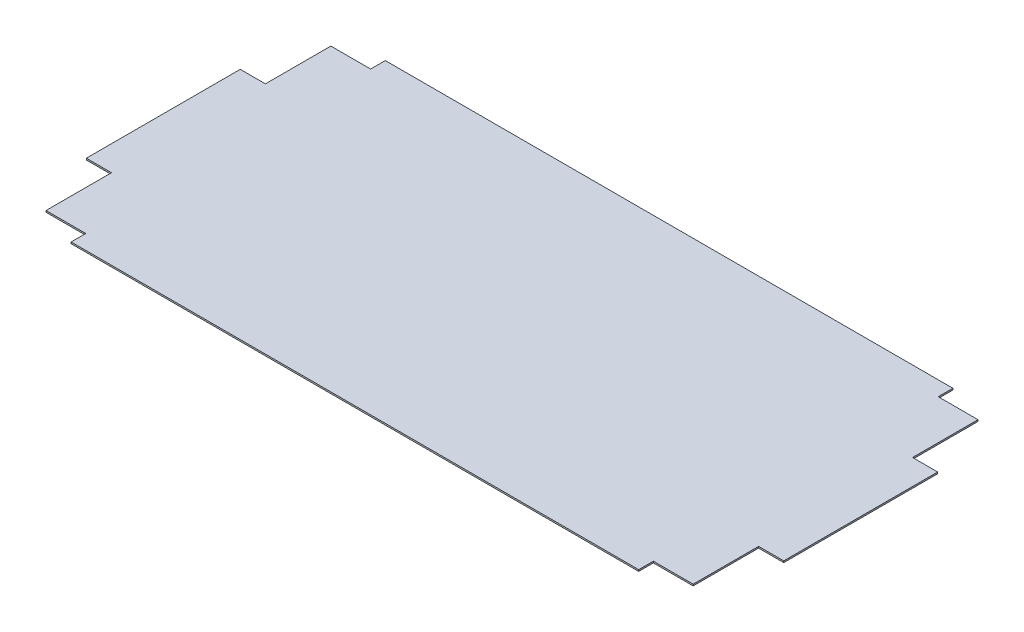
ISO-10303-21;
HEADER;
FILE_DESCRIPTION(('STEP AP214'),'2;1');
FILE_NAME('part.step','',(''),(''),'','','');
FILE_SCHEMA(('AUTOMOTIVE_DESIGN { 1 0 10303 214 1 1 1 1 }'));
ENDSEC;
DATA;
#1=APPLICATION_CONTEXT('core data for automotive mechanical design processes');
#2=APPLICATION_PROTOCOL_DEFINITION('international standard','automotive_design',2000,#1);
#3=PRODUCT_CONTEXT('',#1,'mechanical');
#4=PRODUCT('Part','Part','',(#3));
#5=PRODUCT_RELATED_PRODUCT_CATEGORY('part','',(#4));
#6=PRODUCT_DEFINITION_FORMATION('','',#4);
#7=PRODUCT_DEFINITION_CONTEXT('part definition',#1,'design');
#8=PRODUCT_DEFINITION('design','',#6,#7);
#9=PRODUCT_DEFINITION_SHAPE('','',#8);
#10=(LENGTH_UNIT() NAMED_UNIT(*) SI_UNIT(.MILLI.,.METRE.));
#11=(NAMED_UNIT(*) PLANE_ANGLE_UNIT() SI_UNIT($,.RADIAN.));
#12=(NAMED_UNIT(*) SI_UNIT($,.STERADIAN.) SOLID_ANGLE_UNIT());
#13=UNCERTAINTY_MEASURE_WITH_UNIT(LENGTH_MEASURE(1.E-05),#10,'distance_accuracy_value','');
#14=(GEOMETRIC_REPRESENTATION_CONTEXT(3) GLOBAL_UNCERTAINTY_ASSIGNED_CONTEXT((#13)) GLOBAL_UNIT_ASSIGNED_CONTEXT((#10,
#11,#12)) REPRESENTATION_CONTEXT('',''));
#15=CARTESIAN_POINT('',(0.,0.,0.));
#16=DIRECTION('',(0.,0.,1.));
#17=DIRECTION('',(1.,0.,0.));
#18=AXIS2_PLACEMENT_3D('',#15,#16,#17);
#19=CARTESIAN_POINT('',(333.,1.5,150.));
#20=DIRECTION('',(-1.,0.,0.));
#21=DIRECTION('',(0.,0.,1.));
#22=AXIS2_PLACEMENT_3D('',#19,#20,#21);
#23=PLANE('',#22);
#24=DIRECTION('',(0.,0.,-1.));
#25=VECTOR('',#24,1.);
#26=CARTESIAN_POINT('',(333.,1.5,150.));
#27=LINE('',#26,#25);
#28=CARTESIAN_POINT('',(333.,1.5,73.5000000000002));
#29=VERTEX_POINT('',#28);
#30=CARTESIAN_POINT('',(333.,1.5,-73.5));
#31=VERTEX_POINT('',#30);
#32=EDGE_CURVE('E317',#29,#31,#27,.T.);
#33=ORIENTED_EDGE('',*,*,#32,.F.);
#34=DIRECTION('',(0.,1.,0.));
#35=VECTOR('',#34,1.);
#36=CARTESIAN_POINT('',(333.,0.,73.5000000000002));
#37=LINE('',#36,#35);
#38=CARTESIAN_POINT('',(333.,0.,73.5000000000002));
#39=VERTEX_POINT('',#38);
#40=EDGE_CURVE('E203',#39,#29,#37,.T.);
#41=ORIENTED_EDGE('',*,*,#40,.F.);
#42=DIRECTION('',(0.,0.,-1.));
#43=VECTOR('',#42,1.);
#44=CARTESIAN_POINT('',(333.,0.,150.));
#45=LINE('',#44,#43);
#46=CARTESIAN_POINT('',(333.,0.,-73.5));
#47=VERTEX_POINT('',#46);
#48=EDGE_CURVE('E315',#39,#47,#45,.T.);
#49=ORIENTED_EDGE('',*,*,#48,.T.);
#50=DIRECTION('',(0.,1.,0.));
#51=VECTOR('',#50,1.);
#52=CARTESIAN_POINT('',(333.,0.,-73.5));
#53=LINE('',#52,#51);
#54=EDGE_CURVE('E217',#47,#31,#53,.T.);
#55=ORIENTED_EDGE('',*,*,#54,.T.);
#56=EDGE_LOOP('',(#33,#41,#49,#55));
#57=FACE_BOUND('',#56,.T.);
#58=ADVANCED_FACE('F32',(#57),#23,.F.);
#59=CARTESIAN_POINT('',(-333.,1.5,-150.));
#60=DIRECTION('',(0.,0.,1.));
#61=DIRECTION('',(1.,0.,0.));
#62=AXIS2_PLACEMENT_3D('',#59,#60,#61);
#63=PLANE('',#62);
#64=DIRECTION('',(-1.,0.,0.));
#65=VECTOR('',#64,1.);
#66=CARTESIAN_POINT('',(-333.,1.5,-150.));
#67=LINE('',#66,#65);
#68=CARTESIAN_POINT('',(271.,1.5,-150.));
#69=VERTEX_POINT('',#68);
#70=CARTESIAN_POINT('',(-271.,1.5,-150.));
#71=VERTEX_POINT('',#70);
#72=EDGE_CURVE('E319',#69,#71,#67,.T.);
#73=ORIENTED_EDGE('',*,*,#72,.F.);
#74=DIRECTION('',(0.,1.,0.));
#75=VECTOR('',#74,1.);
#76=CARTESIAN_POINT('',(271.,0.,-150.));
#77=LINE('',#76,#75);
#78=CARTESIAN_POINT('',(271.,0.,-150.));
#79=VERTEX_POINT('',#78);
#80=EDGE_CURVE('E271',#79,#69,#77,.T.);
#81=ORIENTED_EDGE('',*,*,#80,.F.);
#82=DIRECTION('',(-1.,0.,0.));
#83=VECTOR('',#82,1.);
#84=CARTESIAN_POINT('',(-333.,0.,-150.));
#85=LINE('',#84,#83);
#86=CARTESIAN_POINT('',(-271.,0.,-150.));
#87=VERTEX_POINT('',#86);
#88=EDGE_CURVE('E324',#79,#87,#85,.T.);
#89=ORIENTED_EDGE('',*,*,#88,.T.);
#90=DIRECTION('',(0.,1.,0.));
#91=VECTOR('',#90,1.);
#92=CARTESIAN_POINT('',(-271.,0.,-150.));
#93=LINE('',#92,#91);
#94=EDGE_CURVE('E294',#87,#71,#93,.T.);
#95=ORIENTED_EDGE('',*,*,#94,.T.);
#96=EDGE_LOOP('',(#73,#81,#89,#95));
#97=FACE_BOUND('',#96,.T.);
#98=ADVANCED_FACE('F372',(#97),#63,.F.);
#99=CARTESIAN_POINT('',(-333.,1.5,150.));
#100=DIRECTION('',(1.,0.,0.));
#101=DIRECTION('',(0.,0.,-1.));
#102=AXIS2_PLACEMENT_3D('',#99,#100,#101);
#103=PLANE('',#102);
#104=DIRECTION('',(0.,0.,1.));
#105=VECTOR('',#104,1.);
#106=CARTESIAN_POINT('',(-333.,0.,150.));
#107=LINE('',#106,#105);
#108=CARTESIAN_POINT('',(-333.,0.,-73.5));
#109=VERTEX_POINT('',#108);
#110=CARTESIAN_POINT('',(-333.,0.,73.5000000000002));
#111=VERTEX_POINT('',#110);
#112=EDGE_CURVE('E325',#109,#111,#107,.T.);
#113=ORIENTED_EDGE('',*,*,#112,.T.);
#114=DIRECTION('',(0.,1.,0.));
#115=VECTOR('',#114,1.);
#116=CARTESIAN_POINT('',(-333.,0.,73.5000000000002));
#117=LINE('',#116,#115);
#118=CARTESIAN_POINT('',(-333.,1.5,73.5000000000002));
#119=VERTEX_POINT('',#118);
#120=EDGE_CURVE('E190',#111,#119,#117,.T.);
#121=ORIENTED_EDGE('',*,*,#120,.T.);
#122=DIRECTION('',(0.,0.,1.));
#123=VECTOR('',#122,1.);
#124=CARTESIAN_POINT('',(-333.,1.5,150.));
#125=LINE('',#124,#123);
#126=CARTESIAN_POINT('',(-333.,1.5,-73.5));
#127=VERTEX_POINT('',#126);
#128=EDGE_CURVE('E40',#127,#119,#125,.T.);
#129=ORIENTED_EDGE('',*,*,#128,.F.);
#130=DIRECTION('',(0.,1.,0.));
#131=VECTOR('',#130,1.);
#132=CARTESIAN_POINT('',(-333.,0.,-73.5));
#133=LINE('',#132,#131);
#134=EDGE_CURVE('E226',#109,#127,#133,.T.);
#135=ORIENTED_EDGE('',*,*,#134,.F.);
#136=EDGE_LOOP('',(#113,#121,#129,#135));
#137=FACE_BOUND('',#136,.T.);
#138=ADVANCED_FACE('F388',(#137),#103,.F.);
#139=CARTESIAN_POINT('',(-333.,1.5,150.));
#140=DIRECTION('',(0.,0.,-1.));
#141=DIRECTION('',(-1.,0.,0.));
#142=AXIS2_PLACEMENT_3D('',#139,#140,#141);
#143=PLANE('',#142);
#144=DIRECTION('',(1.,0.,0.));
#145=VECTOR('',#144,1.);
#146=CARTESIAN_POINT('',(-333.,1.5,150.));
#147=LINE('',#146,#145);
#148=CARTESIAN_POINT('',(-271.,1.5,150.));
#149=VERTEX_POINT('',#148);
#150=CARTESIAN_POINT('',(271.,1.5,150.));
#151=VERTEX_POINT('',#150);
#152=EDGE_CURVE('E11',#149,#151,#147,.T.);
#153=ORIENTED_EDGE('',*,*,#152,.F.);
#154=DIRECTION('',(0.,1.,0.));
#155=VECTOR('',#154,1.);
#156=CARTESIAN_POINT('',(-271.,0.,150.));
#157=LINE('',#156,#155);
#158=CARTESIAN_POINT('',(-271.,0.,150.));
#159=VERTEX_POINT('',#158);
#160=EDGE_CURVE('E237',#159,#149,#157,.T.);
#161=ORIENTED_EDGE('',*,*,#160,.F.);
#162=DIRECTION('',(1.,0.,0.));
#163=VECTOR('',#162,1.);
#164=CARTESIAN_POINT('',(-333.,0.,150.));
#165=LINE('',#164,#163);
#166=CARTESIAN_POINT('',(271.,0.,150.));
#167=VERTEX_POINT('',#166);
#168=EDGE_CURVE('E35',#159,#167,#165,.T.);
#169=ORIENTED_EDGE('',*,*,#168,.T.);
#170=DIRECTION('',(0.,1.,0.));
#171=VECTOR('',#170,1.);
#172=CARTESIAN_POINT('',(271.,0.,150.));
#173=LINE('',#172,#171);
#174=EDGE_CURVE('E257',#167,#151,#173,.T.);
#175=ORIENTED_EDGE('',*,*,#174,.T.);
#176=EDGE_LOOP('',(#153,#161,#169,#175));
#177=FACE_BOUND('',#176,.T.);
#178=ADVANCED_FACE('F333',(#177),#143,.F.);
#179=CARTESIAN_POINT('',(0.,1.5,0.));
#180=DIRECTION('',(0.,-1.,0.));
#181=DIRECTION('',(0.,0.,-1.));
#182=AXIS2_PLACEMENT_3D('',#179,#180,#181);
#183=PLANE('',#182);
#184=ORIENTED_EDGE('',*,*,#128,.T.);
#185=DIRECTION('',(-1.,0.,0.));
#186=VECTOR('',#185,1.);
#187=CARTESIAN_POINT('',(-333.,1.5,73.5000000000002));
#188=LINE('',#187,#186);
#189=CARTESIAN_POINT('',(-309.,1.5,73.5000000000002));
#190=VERTEX_POINT('',#189);
#191=EDGE_CURVE('E194',#190,#119,#188,.T.);
#192=ORIENTED_EDGE('',*,*,#191,.F.);
#193=DIRECTION('',(0.,0.,-1.));
#194=VECTOR('',#193,1.);
#195=CARTESIAN_POINT('',(-309.,1.5,150.));
#196=LINE('',#195,#194);
#197=CARTESIAN_POINT('',(-309.,1.5,136.));
#198=VERTEX_POINT('',#197);
#199=EDGE_CURVE('E182',#198,#190,#196,.T.);
#200=ORIENTED_EDGE('',*,*,#199,.F.);
#201=DIRECTION('',(-1.,0.,0.));
#202=VECTOR('',#201,1.);
#203=CARTESIAN_POINT('',(-309.,1.5,136.));
#204=LINE('',#203,#202);
#205=CARTESIAN_POINT('',(-271.,1.5,136.));
#206=VERTEX_POINT('',#205);
#207=EDGE_CURVE('E48',#206,#198,#204,.T.);
#208=ORIENTED_EDGE('',*,*,#207,.F.);
#209=DIRECTION('',(0.,0.,-1.));
#210=VECTOR('',#209,1.);
#211=CARTESIAN_POINT('',(-271.,1.5,150.));
#212=LINE('',#211,#210);
#213=EDGE_CURVE('E232',#149,#206,#212,.T.);
#214=ORIENTED_EDGE('',*,*,#213,.F.);
#215=ORIENTED_EDGE('',*,*,#152,.T.);
#216=DIRECTION('',(0.,0.,1.));
#217=VECTOR('',#216,1.);
#218=CARTESIAN_POINT('',(271.,1.5,150.));
#219=LINE('',#218,#217);
#220=CARTESIAN_POINT('',(271.,1.5,136.));
#221=VERTEX_POINT('',#220);
#222=EDGE_CURVE('E249',#221,#151,#219,.T.);
#223=ORIENTED_EDGE('',*,*,#222,.F.);
#224=DIRECTION('',(-1.,0.,0.));
#225=VECTOR('',#224,1.);
#226=CARTESIAN_POINT('',(309.,1.5,136.));
#227=LINE('',#226,#225);
#228=CARTESIAN_POINT('',(309.,1.5,136.));
#229=VERTEX_POINT('',#228);
#230=EDGE_CURVE('E243',#229,#221,#227,.T.);
#231=ORIENTED_EDGE('',*,*,#230,.F.);
#232=DIRECTION('',(0.,0.,1.));
#233=VECTOR('',#232,1.);
#234=CARTESIAN_POINT('',(309.,1.5,150.));
#235=LINE('',#234,#233);
#236=CARTESIAN_POINT('',(309.,1.5,73.5000000000002));
#237=VERTEX_POINT('',#236);
#238=EDGE_CURVE('E297',#237,#229,#235,.T.);
#239=ORIENTED_EDGE('',*,*,#238,.F.);
#240=DIRECTION('',(-1.,0.,0.));
#241=VECTOR('',#240,1.);
#242=CARTESIAN_POINT('',(333.,1.5,73.5000000000002));
#243=LINE('',#242,#241);
#244=EDGE_CURVE('E198',#29,#237,#243,.T.);
#245=ORIENTED_EDGE('',*,*,#244,.F.);
#246=ORIENTED_EDGE('',*,*,#32,.T.);
#247=DIRECTION('',(1.,0.,0.));
#248=VECTOR('',#247,1.);
#249=CARTESIAN_POINT('',(333.,1.5,-73.5));
#250=LINE('',#249,#248);
#251=CARTESIAN_POINT('',(309.,1.5,-73.5));
#252=VERTEX_POINT('',#251);
#253=EDGE_CURVE('E209',#252,#31,#250,.T.);
#254=ORIENTED_EDGE('',*,*,#253,.F.);
#255=DIRECTION('',(0.,0.,1.));
#256=VECTOR('',#255,1.);
#257=CARTESIAN_POINT('',(309.,1.5,-150.));
#258=LINE('',#257,#256);
#259=CARTESIAN_POINT('',(309.,1.5,-136.));
#260=VERTEX_POINT('',#259);
#261=EDGE_CURVE('E310',#260,#252,#258,.T.);
#262=ORIENTED_EDGE('',*,*,#261,.F.);
#263=DIRECTION('',(1.,0.,0.));
#264=VECTOR('',#263,1.);
#265=CARTESIAN_POINT('',(309.,1.5,-136.));
#266=LINE('',#265,#264);
#267=CARTESIAN_POINT('',(271.,1.5,-136.));
#268=VERTEX_POINT('',#267);
#269=EDGE_CURVE('E268',#268,#260,#266,.T.);
#270=ORIENTED_EDGE('',*,*,#269,.F.);
#271=DIRECTION('',(0.,0.,1.));
#272=VECTOR('',#271,1.);
#273=CARTESIAN_POINT('',(271.,1.5,-150.));
#274=LINE('',#273,#272);
#275=EDGE_CURVE('E260',#69,#268,#274,.T.);
#276=ORIENTED_EDGE('',*,*,#275,.F.);
#277=ORIENTED_EDGE('',*,*,#72,.T.);
#278=DIRECTION('',(0.,0.,-1.));
#279=VECTOR('',#278,1.);
#280=CARTESIAN_POINT('',(-271.,1.5,-150.));
#281=LINE('',#280,#279);
#282=CARTESIAN_POINT('',(-271.,1.5,-136.));
#283=VERTEX_POINT('',#282);
#284=EDGE_CURVE('E286',#283,#71,#281,.T.);
#285=ORIENTED_EDGE('',*,*,#284,.F.);
#286=DIRECTION('',(1.,0.,0.));
#287=VECTOR('',#286,1.);
#288=CARTESIAN_POINT('',(-309.,1.5,-136.));
#289=LINE('',#288,#287);
#290=CARTESIAN_POINT('',(-309.,1.5,-136.));
#291=VERTEX_POINT('',#290);
#292=EDGE_CURVE('E278',#291,#283,#289,.T.);
#293=ORIENTED_EDGE('',*,*,#292,.F.);
#294=DIRECTION('',(0.,0.,-1.));
#295=VECTOR('',#294,1.);
#296=CARTESIAN_POINT('',(-309.,1.5,-150.));
#297=LINE('',#296,#295);
#298=CARTESIAN_POINT('',(-309.,1.5,-73.5));
#299=VERTEX_POINT('',#298);
#300=EDGE_CURVE('E181',#299,#291,#297,.T.);
#301=ORIENTED_EDGE('',*,*,#300,.F.);
#302=DIRECTION('',(1.,0.,0.));
#303=VECTOR('',#302,1.);
#304=CARTESIAN_POINT('',(-333.,1.5,-73.5));
#305=LINE('',#304,#303);
#306=EDGE_CURVE('E220',#127,#299,#305,.T.);
#307=ORIENTED_EDGE('',*,*,#306,.F.);
#308=EDGE_LOOP('',(#184,#192,#200,#208,#214,#215,#223,#231,#239,#245,#246,#254,#262,#270,#276,
#277,#285,#293,#301,#307));
#309=FACE_BOUND('',#308,.T.);
#310=ADVANCED_FACE('F348',(#309),#183,.F.);
#311=CARTESIAN_POINT('',(0.,0.,0.));
#312=DIRECTION('',(0.,-1.,0.));
#313=DIRECTION('',(0.,0.,-1.));
#314=AXIS2_PLACEMENT_3D('',#311,#312,#313);
#315=PLANE('',#314);
#316=DIRECTION('',(-1.,0.,0.));
#317=VECTOR('',#316,1.);
#318=CARTESIAN_POINT('',(-333.,0.,73.5000000000002));
#319=LINE('',#318,#317);
#320=CARTESIAN_POINT('',(-309.,0.,73.5000000000002));
#321=VERTEX_POINT('',#320);
#322=EDGE_CURVE('E175',#321,#111,#319,.T.);
#323=ORIENTED_EDGE('',*,*,#322,.T.);
#324=ORIENTED_EDGE('',*,*,#112,.F.);
#325=DIRECTION('',(1.,0.,0.));
#326=VECTOR('',#325,1.);
#327=CARTESIAN_POINT('',(-333.,0.,-73.5));
#328=LINE('',#327,#326);
#329=CARTESIAN_POINT('',(-309.,0.,-73.5));
#330=VERTEX_POINT('',#329);
#331=EDGE_CURVE('E223',#109,#330,#328,.T.);
#332=ORIENTED_EDGE('',*,*,#331,.T.);
#333=DIRECTION('',(0.,0.,-1.));
#334=VECTOR('',#333,1.);
#335=CARTESIAN_POINT('',(-309.,0.,-150.));
#336=LINE('',#335,#334);
#337=CARTESIAN_POINT('',(-309.,0.,-136.));
#338=VERTEX_POINT('',#337);
#339=EDGE_CURVE('E307',#330,#338,#336,.T.);
#340=ORIENTED_EDGE('',*,*,#339,.T.);
#341=DIRECTION('',(1.,0.,0.));
#342=VECTOR('',#341,1.);
#343=CARTESIAN_POINT('',(-309.,0.,-136.));
#344=LINE('',#343,#342);
#345=CARTESIAN_POINT('',(-271.,0.,-136.));
#346=VERTEX_POINT('',#345);
#347=EDGE_CURVE('E282',#338,#346,#344,.T.);
#348=ORIENTED_EDGE('',*,*,#347,.T.);
#349=DIRECTION('',(0.,0.,-1.));
#350=VECTOR('',#349,1.);
#351=CARTESIAN_POINT('',(-271.,0.,-150.));
#352=LINE('',#351,#350);
#353=EDGE_CURVE('E285',#346,#87,#352,.T.);
#354=ORIENTED_EDGE('',*,*,#353,.T.);
#355=ORIENTED_EDGE('',*,*,#88,.F.);
#356=DIRECTION('',(0.,0.,1.));
#357=VECTOR('',#356,1.);
#358=CARTESIAN_POINT('',(271.,0.,-150.));
#359=LINE('',#358,#357);
#360=CARTESIAN_POINT('',(271.,0.,-136.));
#361=VERTEX_POINT('',#360);
#362=EDGE_CURVE('E264',#79,#361,#359,.T.);
#363=ORIENTED_EDGE('',*,*,#362,.T.);
#364=DIRECTION('',(1.,0.,0.));
#365=VECTOR('',#364,1.);
#366=CARTESIAN_POINT('',(309.,0.,-136.));
#367=LINE('',#366,#365);
#368=CARTESIAN_POINT('',(309.,0.,-136.));
#369=VERTEX_POINT('',#368);
#370=EDGE_CURVE('E267',#361,#369,#367,.T.);
#371=ORIENTED_EDGE('',*,*,#370,.T.);
#372=DIRECTION('',(0.,0.,1.));
#373=VECTOR('',#372,1.);
#374=CARTESIAN_POINT('',(309.,0.,-150.));
#375=LINE('',#374,#373);
#376=CARTESIAN_POINT('',(309.,0.,-73.5));
#377=VERTEX_POINT('',#376);
#378=EDGE_CURVE('E313',#369,#377,#375,.T.);
#379=ORIENTED_EDGE('',*,*,#378,.T.);
#380=DIRECTION('',(1.,0.,0.));
#381=VECTOR('',#380,1.);
#382=CARTESIAN_POINT('',(333.,0.,-73.5));
#383=LINE('',#382,#381);
#384=EDGE_CURVE('E211',#377,#47,#383,.T.);
#385=ORIENTED_EDGE('',*,*,#384,.T.);
#386=ORIENTED_EDGE('',*,*,#48,.F.);
#387=DIRECTION('',(-1.,0.,0.));
#388=VECTOR('',#387,1.);
#389=CARTESIAN_POINT('',(333.,0.,73.5000000000002));
#390=LINE('',#389,#388);
#391=CARTESIAN_POINT('',(309.,0.,73.5000000000002));
#392=VERTEX_POINT('',#391);
#393=EDGE_CURVE('E200',#39,#392,#390,.T.);
#394=ORIENTED_EDGE('',*,*,#393,.T.);
#395=DIRECTION('',(0.,0.,1.));
#396=VECTOR('',#395,1.);
#397=CARTESIAN_POINT('',(309.,0.,150.));
#398=LINE('',#397,#396);
#399=CARTESIAN_POINT('',(309.,0.,136.));
#400=VERTEX_POINT('',#399);
#401=EDGE_CURVE('E301',#392,#400,#398,.T.);
#402=ORIENTED_EDGE('',*,*,#401,.T.);
#403=DIRECTION('',(-1.,0.,0.));
#404=VECTOR('',#403,1.);
#405=CARTESIAN_POINT('',(309.,0.,136.));
#406=LINE('',#405,#404);
#407=CARTESIAN_POINT('',(271.,0.,136.));
#408=VERTEX_POINT('',#407);
#409=EDGE_CURVE('E56',#400,#408,#406,.T.);
#410=ORIENTED_EDGE('',*,*,#409,.T.);
#411=DIRECTION('',(0.,0.,1.));
#412=VECTOR('',#411,1.);
#413=CARTESIAN_POINT('',(271.,0.,150.));
#414=LINE('',#413,#412);
#415=EDGE_CURVE('E248',#408,#167,#414,.T.);
#416=ORIENTED_EDGE('',*,*,#415,.T.);
#417=ORIENTED_EDGE('',*,*,#168,.F.);
#418=DIRECTION('',(0.,0.,-1.));
#419=VECTOR('',#418,1.);
#420=CARTESIAN_POINT('',(-271.,0.,150.));
#421=LINE('',#420,#419);
#422=CARTESIAN_POINT('',(-271.,0.,136.));
#423=VERTEX_POINT('',#422);
#424=EDGE_CURVE('E234',#159,#423,#421,.T.);
#425=ORIENTED_EDGE('',*,*,#424,.T.);
#426=DIRECTION('',(-1.,0.,0.));
#427=VECTOR('',#426,1.);
#428=CARTESIAN_POINT('',(-309.,0.,136.));
#429=LINE('',#428,#427);
#430=CARTESIAN_POINT('',(-309.,0.,136.));
#431=VERTEX_POINT('',#430);
#432=EDGE_CURVE('E179',#423,#431,#429,.T.);
#433=ORIENTED_EDGE('',*,*,#432,.T.);
#434=DIRECTION('',(0.,0.,-1.));
#435=VECTOR('',#434,1.);
#436=CARTESIAN_POINT('',(-309.,0.,150.));
#437=LINE('',#436,#435);
#438=EDGE_CURVE('E170',#431,#321,#437,.T.);
#439=ORIENTED_EDGE('',*,*,#438,.T.);
#440=EDGE_LOOP('',(#323,#324,#332,#340,#348,#354,#355,#363,#371,#379,#385,#386,#394,#402,#410,
#416,#417,#425,#433,#439));
#441=FACE_BOUND('',#440,.T.);
#442=ADVANCED_FACE('F172',(#441),#315,.T.);
#443=CARTESIAN_POINT('',(309.,0.,-150.));
#444=DIRECTION('',(-1.,0.,0.));
#445=DIRECTION('',(0.,0.,1.));
#446=AXIS2_PLACEMENT_3D('',#443,#444,#445);
#447=PLANE('',#446);
#448=ORIENTED_EDGE('',*,*,#378,.F.);
#449=DIRECTION('',(0.,1.,0.));
#450=VECTOR('',#449,1.);
#451=CARTESIAN_POINT('',(309.,0.,-136.));
#452=LINE('',#451,#450);
#453=EDGE_CURVE('E275',#369,#260,#452,.T.);
#454=ORIENTED_EDGE('',*,*,#453,.T.);
#455=ORIENTED_EDGE('',*,*,#261,.T.);
#456=DIRECTION('',(0.,1.,0.));
#457=VECTOR('',#456,1.);
#458=CARTESIAN_POINT('',(309.,0.,-73.5));
#459=LINE('',#458,#457);
#460=EDGE_CURVE('E214',#377,#252,#459,.T.);
#461=ORIENTED_EDGE('',*,*,#460,.F.);
#462=EDGE_LOOP('',(#448,#454,#455,#461));
#463=FACE_BOUND('',#462,.T.);
#464=ADVANCED_FACE('F360',(#463),#447,.F.);
#465=CARTESIAN_POINT('',(-309.,0.,-150.));
#466=DIRECTION('',(1.,0.,0.));
#467=DIRECTION('',(0.,0.,-1.));
#468=AXIS2_PLACEMENT_3D('',#465,#466,#467);
#469=PLANE('',#468);
#470=ORIENTED_EDGE('',*,*,#300,.T.);
#471=DIRECTION('',(0.,1.,0.));
#472=VECTOR('',#471,1.);
#473=CARTESIAN_POINT('',(-309.,0.,-136.));
#474=LINE('',#473,#472);
#475=EDGE_CURVE('E289',#338,#291,#474,.T.);
#476=ORIENTED_EDGE('',*,*,#475,.F.);
#477=ORIENTED_EDGE('',*,*,#339,.F.);
#478=DIRECTION('',(0.,1.,0.));
#479=VECTOR('',#478,1.);
#480=CARTESIAN_POINT('',(-309.,0.,-73.5));
#481=LINE('',#480,#479);
#482=EDGE_CURVE('E229',#330,#299,#481,.T.);
#483=ORIENTED_EDGE('',*,*,#482,.T.);
#484=EDGE_LOOP('',(#470,#476,#477,#483));
#485=FACE_BOUND('',#484,.T.);
#486=ADVANCED_FACE('F383',(#485),#469,.F.);
#487=CARTESIAN_POINT('',(-309.,0.,150.));
#488=DIRECTION('',(1.,0.,0.));
#489=DIRECTION('',(0.,0.,-1.));
#490=AXIS2_PLACEMENT_3D('',#487,#488,#489);
#491=PLANE('',#490);
#492=ORIENTED_EDGE('',*,*,#438,.F.);
#493=DIRECTION('',(0.,1.,0.));
#494=VECTOR('',#493,1.);
#495=CARTESIAN_POINT('',(-309.,0.,136.));
#496=LINE('',#495,#494);
#497=EDGE_CURVE('E241',#431,#198,#496,.T.);
#498=ORIENTED_EDGE('',*,*,#497,.T.);
#499=ORIENTED_EDGE('',*,*,#199,.T.);
#500=DIRECTION('',(0.,1.,0.));
#501=VECTOR('',#500,1.);
#502=CARTESIAN_POINT('',(-309.,0.,73.5000000000002));
#503=LINE('',#502,#501);
#504=EDGE_CURVE('E185',#321,#190,#503,.T.);
#505=ORIENTED_EDGE('',*,*,#504,.F.);
#506=EDGE_LOOP('',(#492,#498,#499,#505));
#507=FACE_BOUND('',#506,.T.);
#508=ADVANCED_FACE('F186',(#507),#491,.F.);
#509=CARTESIAN_POINT('',(309.,0.,150.));
#510=DIRECTION('',(-1.,0.,0.));
#511=DIRECTION('',(0.,0.,1.));
#512=AXIS2_PLACEMENT_3D('',#509,#510,#511);
#513=PLANE('',#512);
#514=ORIENTED_EDGE('',*,*,#238,.T.);
#515=DIRECTION('',(0.,1.,0.));
#516=VECTOR('',#515,1.);
#517=CARTESIAN_POINT('',(309.,0.,136.));
#518=LINE('',#517,#516);
#519=EDGE_CURVE('E252',#400,#229,#518,.T.);
#520=ORIENTED_EDGE('',*,*,#519,.F.);
#521=ORIENTED_EDGE('',*,*,#401,.F.);
#522=DIRECTION('',(0.,1.,0.));
#523=VECTOR('',#522,1.);
#524=CARTESIAN_POINT('',(309.,0.,73.5000000000002));
#525=LINE('',#524,#523);
#526=EDGE_CURVE('E206',#392,#237,#525,.T.);
#527=ORIENTED_EDGE('',*,*,#526,.T.);
#528=EDGE_LOOP('',(#514,#520,#521,#527));
#529=FACE_BOUND('',#528,.T.);
#530=ADVANCED_FACE('F341',(#529),#513,.F.);
#531=CARTESIAN_POINT('',(-271.,0.,-150.));
#532=DIRECTION('',(1.,0.,0.));
#533=DIRECTION('',(0.,0.,-1.));
#534=AXIS2_PLACEMENT_3D('',#531,#532,#533);
#535=PLANE('',#534);
#536=ORIENTED_EDGE('',*,*,#284,.T.);
#537=ORIENTED_EDGE('',*,*,#94,.F.);
#538=ORIENTED_EDGE('',*,*,#353,.F.);
#539=DIRECTION('',(0.,1.,0.));
#540=VECTOR('',#539,1.);
#541=CARTESIAN_POINT('',(-271.,0.,-136.));
#542=LINE('',#541,#540);
#543=EDGE_CURVE('E298',#346,#283,#542,.T.);
#544=ORIENTED_EDGE('',*,*,#543,.T.);
#545=EDGE_LOOP('',(#536,#537,#538,#544));
#546=FACE_BOUND('',#545,.T.);
#547=ADVANCED_FACE('F376',(#546),#535,.F.);
#548=CARTESIAN_POINT('',(-309.,0.,-136.));
#549=DIRECTION('',(0.,0.,1.));
#550=DIRECTION('',(1.,0.,0.));
#551=AXIS2_PLACEMENT_3D('',#548,#549,#550);
#552=PLANE('',#551);
#553=ORIENTED_EDGE('',*,*,#292,.T.);
#554=ORIENTED_EDGE('',*,*,#543,.F.);
#555=ORIENTED_EDGE('',*,*,#347,.F.);
#556=ORIENTED_EDGE('',*,*,#475,.T.);
#557=EDGE_LOOP('',(#553,#554,#555,#556));
#558=FACE_BOUND('',#557,.T.);
#559=ADVANCED_FACE('F422',(#558),#552,.F.);
#560=CARTESIAN_POINT('',(309.,0.,-136.));
#561=DIRECTION('',(0.,0.,1.));
#562=DIRECTION('',(1.,0.,0.));
#563=AXIS2_PLACEMENT_3D('',#560,#561,#562);
#564=PLANE('',#563);
#565=ORIENTED_EDGE('',*,*,#269,.T.);
#566=ORIENTED_EDGE('',*,*,#453,.F.);
#567=ORIENTED_EDGE('',*,*,#370,.F.);
#568=DIRECTION('',(0.,1.,0.));
#569=VECTOR('',#568,1.);
#570=CARTESIAN_POINT('',(271.,0.,-136.));
#571=LINE('',#570,#569);
#572=EDGE_CURVE('E279',#361,#268,#571,.T.);
#573=ORIENTED_EDGE('',*,*,#572,.T.);
#574=EDGE_LOOP('',(#565,#566,#567,#573));
#575=FACE_BOUND('',#574,.T.);
#576=ADVANCED_FACE('F366',(#575),#564,.F.);
#577=CARTESIAN_POINT('',(271.,0.,-150.));
#578=DIRECTION('',(-1.,0.,0.));
#579=DIRECTION('',(0.,0.,1.));
#580=AXIS2_PLACEMENT_3D('',#577,#578,#579);
#581=PLANE('',#580);
#582=ORIENTED_EDGE('',*,*,#275,.T.);
#583=ORIENTED_EDGE('',*,*,#572,.F.);
#584=ORIENTED_EDGE('',*,*,#362,.F.);
#585=ORIENTED_EDGE('',*,*,#80,.T.);
#586=EDGE_LOOP('',(#582,#583,#584,#585));
#587=FACE_BOUND('',#586,.T.);
#588=ADVANCED_FACE('F368',(#587),#581,.F.);
#589=CARTESIAN_POINT('',(271.,0.,150.));
#590=DIRECTION('',(-1.,0.,0.));
#591=DIRECTION('',(0.,0.,1.));
#592=AXIS2_PLACEMENT_3D('',#589,#590,#591);
#593=PLANE('',#592);
#594=ORIENTED_EDGE('',*,*,#222,.T.);
#595=ORIENTED_EDGE('',*,*,#174,.F.);
#596=ORIENTED_EDGE('',*,*,#415,.F.);
#597=DIRECTION('',(0.,1.,0.));
#598=VECTOR('',#597,1.);
#599=CARTESIAN_POINT('',(271.,0.,136.));
#600=LINE('',#599,#598);
#601=EDGE_CURVE('E261',#408,#221,#600,.T.);
#602=ORIENTED_EDGE('',*,*,#601,.T.);
#603=EDGE_LOOP('',(#594,#595,#596,#602));
#604=FACE_BOUND('',#603,.T.);
#605=ADVANCED_FACE('F336',(#604),#593,.F.);
#606=CARTESIAN_POINT('',(309.,0.,136.));
#607=DIRECTION('',(0.,0.,-1.));
#608=DIRECTION('',(-1.,0.,0.));
#609=AXIS2_PLACEMENT_3D('',#606,#607,#608);
#610=PLANE('',#609);
#611=ORIENTED_EDGE('',*,*,#230,.T.);
#612=ORIENTED_EDGE('',*,*,#601,.F.);
#613=ORIENTED_EDGE('',*,*,#409,.F.);
#614=ORIENTED_EDGE('',*,*,#519,.T.);
#615=EDGE_LOOP('',(#611,#612,#613,#614));
#616=FACE_BOUND('',#615,.T.);
#617=ADVANCED_FACE('F457',(#616),#610,.F.);
#618=CARTESIAN_POINT('',(-309.,0.,136.));
#619=DIRECTION('',(0.,0.,-1.));
#620=DIRECTION('',(-1.,0.,0.));
#621=AXIS2_PLACEMENT_3D('',#618,#619,#620);
#622=PLANE('',#621);
#623=ORIENTED_EDGE('',*,*,#207,.T.);
#624=ORIENTED_EDGE('',*,*,#497,.F.);
#625=ORIENTED_EDGE('',*,*,#432,.F.);
#626=DIRECTION('',(0.,1.,0.));
#627=VECTOR('',#626,1.);
#628=CARTESIAN_POINT('',(-271.,0.,136.));
#629=LINE('',#628,#627);
#630=EDGE_CURVE('E244',#423,#206,#629,.T.);
#631=ORIENTED_EDGE('',*,*,#630,.T.);
#632=EDGE_LOOP('',(#623,#624,#625,#631));
#633=FACE_BOUND('',#632,.T.);
#634=ADVANCED_FACE('F466',(#633),#622,.F.);
#635=CARTESIAN_POINT('',(-271.,0.,150.));
#636=DIRECTION('',(1.,0.,0.));
#637=DIRECTION('',(0.,0.,-1.));
#638=AXIS2_PLACEMENT_3D('',#635,#636,#637);
#639=PLANE('',#638);
#640=ORIENTED_EDGE('',*,*,#213,.T.);
#641=ORIENTED_EDGE('',*,*,#630,.F.);
#642=ORIENTED_EDGE('',*,*,#424,.F.);
#643=ORIENTED_EDGE('',*,*,#160,.T.);
#644=EDGE_LOOP('',(#640,#641,#642,#643));
#645=FACE_BOUND('',#644,.T.);
#646=ADVANCED_FACE('F474',(#645),#639,.F.);
#647=CARTESIAN_POINT('',(-333.,0.,-73.5));
#648=DIRECTION('',(0.,0.,1.));
#649=DIRECTION('',(1.,0.,0.));
#650=AXIS2_PLACEMENT_3D('',#647,#648,#649);
#651=PLANE('',#650);
#652=ORIENTED_EDGE('',*,*,#306,.T.);
#653=ORIENTED_EDGE('',*,*,#482,.F.);
#654=ORIENTED_EDGE('',*,*,#331,.F.);
#655=ORIENTED_EDGE('',*,*,#134,.T.);
#656=EDGE_LOOP('',(#652,#653,#654,#655));
#657=FACE_BOUND('',#656,.T.);
#658=ADVANCED_FACE('F386',(#657),#651,.F.);
#659=CARTESIAN_POINT('',(333.,0.,-73.5));
#660=DIRECTION('',(0.,0.,1.));
#661=DIRECTION('',(1.,0.,0.));
#662=AXIS2_PLACEMENT_3D('',#659,#660,#661);
#663=PLANE('',#662);
#664=ORIENTED_EDGE('',*,*,#253,.T.);
#665=ORIENTED_EDGE('',*,*,#54,.F.);
#666=ORIENTED_EDGE('',*,*,#384,.F.);
#667=ORIENTED_EDGE('',*,*,#460,.T.);
#668=EDGE_LOOP('',(#664,#665,#666,#667));
#669=FACE_BOUND('',#668,.T.);
#670=ADVANCED_FACE('F355',(#669),#663,.F.);
#671=CARTESIAN_POINT('',(333.,0.,73.5000000000002));
#672=DIRECTION('',(0.,0.,-1.));
#673=DIRECTION('',(-1.,0.,0.));
#674=AXIS2_PLACEMENT_3D('',#671,#672,#673);
#675=PLANE('',#674);
#676=ORIENTED_EDGE('',*,*,#244,.T.);
#677=ORIENTED_EDGE('',*,*,#526,.F.);
#678=ORIENTED_EDGE('',*,*,#393,.F.);
#679=ORIENTED_EDGE('',*,*,#40,.T.);
#680=EDGE_LOOP('',(#676,#677,#678,#679));
#681=FACE_BOUND('',#680,.T.);
#682=ADVANCED_FACE('F343',(#681),#675,.F.);
#683=CARTESIAN_POINT('',(-333.,0.,73.5000000000002));
#684=DIRECTION('',(0.,0.,-1.));
#685=DIRECTION('',(-1.,0.,0.));
#686=AXIS2_PLACEMENT_3D('',#683,#684,#685);
#687=PLANE('',#686);
#688=ORIENTED_EDGE('',*,*,#191,.T.);
#689=ORIENTED_EDGE('',*,*,#120,.F.);
#690=ORIENTED_EDGE('',*,*,#322,.F.);
#691=ORIENTED_EDGE('',*,*,#504,.T.);
#692=EDGE_LOOP('',(#688,#689,#690,#691));
#693=FACE_BOUND('',#692,.T.);
#694=ADVANCED_FACE('F192',(#693),#687,.F.);
#695=CLOSED_SHELL('',(#58,#98,#138,#178,#310,#442,#464,#486,#508,#530,#547,#559,#576,#588,#605,
#617,#634,#646,#658,#670,#682,#694));
#696=MANIFOLD_SOLID_BREP('B2',#695);
#697=ADVANCED_BREP_SHAPE_REPRESENTATION('',(#18,#696),#14);
#698=SHAPE_DEFINITION_REPRESENTATION(#9,#697);
ENDSEC;
END-ISO-10303-21;
